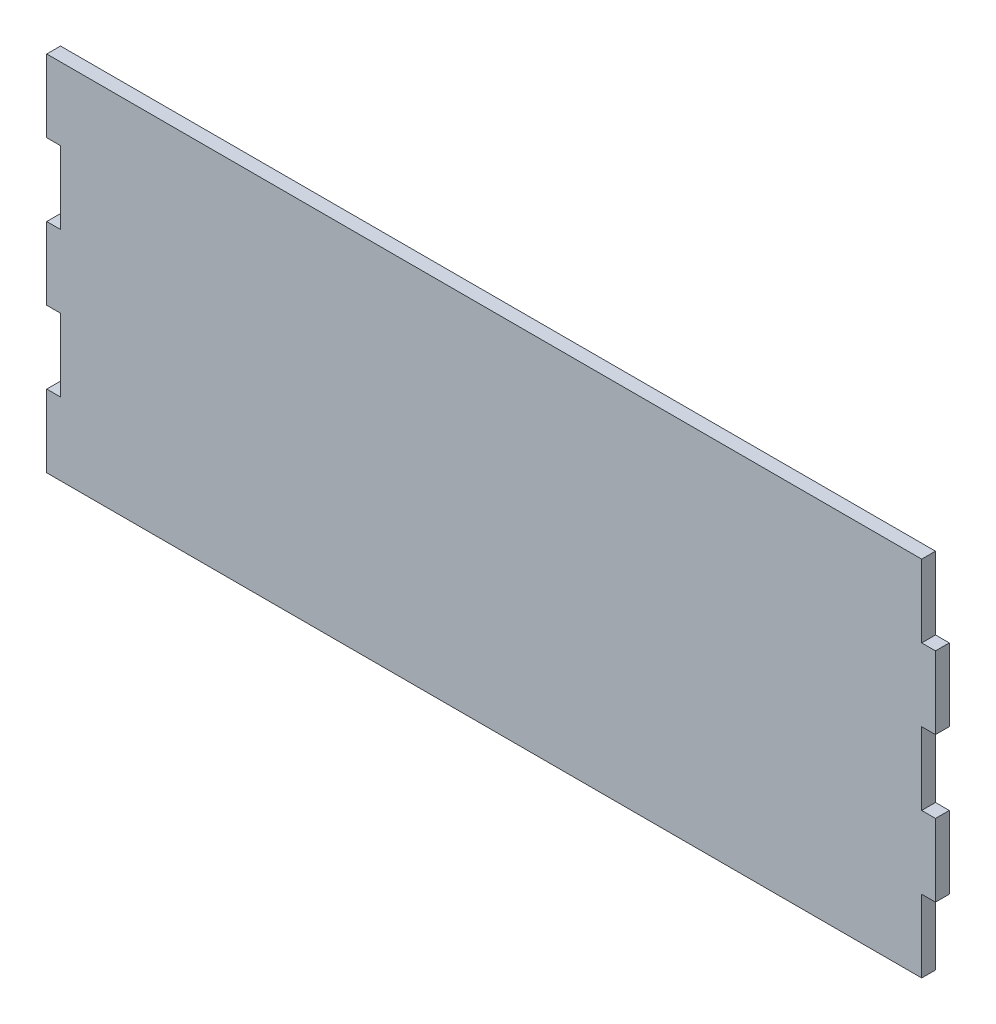
ISO-10303-21;
HEADER;
FILE_DESCRIPTION(('STEP AP214'),'2;1');
FILE_NAME('part.step','',(''),(''),'','','');
FILE_SCHEMA(('AUTOMOTIVE_DESIGN { 1 0 10303 214 1 1 1 1 }'));
ENDSEC;
DATA;
#1=APPLICATION_CONTEXT('core data for automotive mechanical design processes');
#2=APPLICATION_PROTOCOL_DEFINITION('international standard','automotive_design',2000,#1);
#3=PRODUCT_CONTEXT('',#1,'mechanical');
#4=PRODUCT('Part','Part','',(#3));
#5=PRODUCT_RELATED_PRODUCT_CATEGORY('part','',(#4));
#6=PRODUCT_DEFINITION_FORMATION('','',#4);
#7=PRODUCT_DEFINITION_CONTEXT('part definition',#1,'design');
#8=PRODUCT_DEFINITION('design','',#6,#7);
#9=PRODUCT_DEFINITION_SHAPE('','',#8);
#10=(LENGTH_UNIT() NAMED_UNIT(*) SI_UNIT(.MILLI.,.METRE.));
#11=(NAMED_UNIT(*) PLANE_ANGLE_UNIT() SI_UNIT($,.RADIAN.));
#12=(NAMED_UNIT(*) SI_UNIT($,.STERADIAN.) SOLID_ANGLE_UNIT());
#13=UNCERTAINTY_MEASURE_WITH_UNIT(LENGTH_MEASURE(1.E-05),#10,'distance_accuracy_value','');
#14=(GEOMETRIC_REPRESENTATION_CONTEXT(3) GLOBAL_UNCERTAINTY_ASSIGNED_CONTEXT((#13)) GLOBAL_UNIT_ASSIGNED_CONTEXT((#10,
#11,#12)) REPRESENTATION_CONTEXT('',''));
#15=CARTESIAN_POINT('',(0.,0.,0.));
#16=DIRECTION('',(0.,0.,1.));
#17=DIRECTION('',(1.,0.,0.));
#18=AXIS2_PLACEMENT_3D('',#15,#16,#17);
#19=CARTESIAN_POINT('',(0.,101.6,4.826));
#20=DIRECTION('',(-1.,0.,0.));
#21=DIRECTION('',(0.,0.,1.));
#22=AXIS2_PLACEMENT_3D('',#19,#20,#21);
#23=PLANE('',#22);
#24=DIRECTION('',(0.,1.,0.));
#25=VECTOR('',#24,1.);
#26=CARTESIAN_POINT('',(0.,101.6,0.));
#27=LINE('',#26,#25);
#28=CARTESIAN_POINT('',(0.,101.6,0.));
#29=VERTEX_POINT('',#28);
#30=CARTESIAN_POINT('',(0.,127.,0.));
#31=VERTEX_POINT('',#30);
#32=EDGE_CURVE('E205',#29,#31,#27,.T.);
#33=ORIENTED_EDGE('',*,*,#32,.T.);
#34=DIRECTION('',(0.,0.,-1.));
#35=VECTOR('',#34,1.);
#36=CARTESIAN_POINT('',(0.,127.,4.826));
#37=LINE('',#36,#35);
#38=CARTESIAN_POINT('',(0.,127.,4.826));
#39=VERTEX_POINT('',#38);
#40=EDGE_CURVE('E11',#39,#31,#37,.T.);
#41=ORIENTED_EDGE('',*,*,#40,.F.);
#42=DIRECTION('',(0.,1.,0.));
#43=VECTOR('',#42,1.);
#44=CARTESIAN_POINT('',(0.,101.6,4.826));
#45=LINE('',#44,#43);
#46=CARTESIAN_POINT('',(0.,101.6,4.826));
#47=VERTEX_POINT('',#46);
#48=EDGE_CURVE('E257',#47,#39,#45,.T.);
#49=ORIENTED_EDGE('',*,*,#48,.F.);
#50=DIRECTION('',(0.,0.,-1.));
#51=VECTOR('',#50,1.);
#52=CARTESIAN_POINT('',(0.,101.6,4.826));
#53=LINE('',#52,#51);
#54=EDGE_CURVE('E51',#47,#29,#53,.T.);
#55=ORIENTED_EDGE('',*,*,#54,.T.);
#56=EDGE_LOOP('',(#33,#41,#49,#55));
#57=FACE_BOUND('',#56,.T.);
#58=ADVANCED_FACE('F35',(#57),#23,.F.);
#59=CARTESIAN_POINT('',(0.,127.,4.826));
#60=DIRECTION('',(0.,-1.,0.));
#61=DIRECTION('',(0.,0.,-1.));
#62=AXIS2_PLACEMENT_3D('',#59,#60,#61);
#63=PLANE('',#62);
#64=DIRECTION('',(-1.,0.,0.));
#65=VECTOR('',#64,1.);
#66=CARTESIAN_POINT('',(0.,127.,0.));
#67=LINE('',#66,#65);
#68=CARTESIAN_POINT('',(-306.324,127.,0.));
#69=VERTEX_POINT('',#68);
#70=EDGE_CURVE('E207',#31,#69,#67,.T.);
#71=ORIENTED_EDGE('',*,*,#70,.T.);
#72=DIRECTION('',(0.,0.,-1.));
#73=VECTOR('',#72,1.);
#74=CARTESIAN_POINT('',(-306.324,127.,4.826));
#75=LINE('',#74,#73);
#76=CARTESIAN_POINT('',(-306.324,127.,4.826));
#77=VERTEX_POINT('',#76);
#78=EDGE_CURVE('E43',#77,#69,#75,.T.);
#79=ORIENTED_EDGE('',*,*,#78,.F.);
#80=DIRECTION('',(-1.,0.,0.));
#81=VECTOR('',#80,1.);
#82=CARTESIAN_POINT('',(0.,127.,4.826));
#83=LINE('',#82,#81);
#84=EDGE_CURVE('E125',#39,#77,#83,.T.);
#85=ORIENTED_EDGE('',*,*,#84,.F.);
#86=ORIENTED_EDGE('',*,*,#40,.T.);
#87=EDGE_LOOP('',(#71,#79,#85,#86));
#88=FACE_BOUND('',#87,.T.);
#89=ADVANCED_FACE('F297',(#88),#63,.F.);
#90=CARTESIAN_POINT('',(-306.324,101.6,4.826));
#91=DIRECTION('',(-1.,0.,0.));
#92=DIRECTION('',(0.,0.,1.));
#93=AXIS2_PLACEMENT_3D('',#90,#91,#92);
#94=PLANE('',#93);
#95=DIRECTION('',(0.,1.,0.));
#96=VECTOR('',#95,1.);
#97=CARTESIAN_POINT('',(-306.324,101.6,0.));
#98=LINE('',#97,#96);
#99=CARTESIAN_POINT('',(-306.324,101.6,0.));
#100=VERTEX_POINT('',#99);
#101=EDGE_CURVE('E210',#100,#69,#98,.T.);
#102=ORIENTED_EDGE('',*,*,#101,.F.);
#103=DIRECTION('',(0.,0.,-1.));
#104=VECTOR('',#103,1.);
#105=CARTESIAN_POINT('',(-306.324,101.6,4.826));
#106=LINE('',#105,#104);
#107=CARTESIAN_POINT('',(-306.324,101.6,4.826));
#108=VERTEX_POINT('',#107);
#109=EDGE_CURVE('E290',#108,#100,#106,.T.);
#110=ORIENTED_EDGE('',*,*,#109,.F.);
#111=DIRECTION('',(0.,1.,0.));
#112=VECTOR('',#111,1.);
#113=CARTESIAN_POINT('',(-306.324,101.6,4.826));
#114=LINE('',#113,#112);
#115=EDGE_CURVE('E296',#108,#77,#114,.T.);
#116=ORIENTED_EDGE('',*,*,#115,.T.);
#117=ORIENTED_EDGE('',*,*,#78,.T.);
#118=EDGE_LOOP('',(#102,#110,#116,#117));
#119=FACE_BOUND('',#118,.T.);
#120=ADVANCED_FACE('F294',(#119),#94,.T.);
#121=CARTESIAN_POINT('',(-306.324,101.6,4.826));
#122=DIRECTION('',(0.,1.,0.));
#123=DIRECTION('',(0.,0.,1.));
#124=AXIS2_PLACEMENT_3D('',#121,#122,#123);
#125=PLANE('',#124);
#126=DIRECTION('',(1.,0.,0.));
#127=VECTOR('',#126,1.);
#128=CARTESIAN_POINT('',(-306.324,101.6,0.));
#129=LINE('',#128,#127);
#130=CARTESIAN_POINT('',(-301.498,101.6,0.));
#131=VERTEX_POINT('',#130);
#132=EDGE_CURVE('E213',#100,#131,#129,.T.);
#133=ORIENTED_EDGE('',*,*,#132,.T.);
#134=DIRECTION('',(0.,0.,-1.));
#135=VECTOR('',#134,1.);
#136=CARTESIAN_POINT('',(-301.498,101.6,4.826));
#137=LINE('',#136,#135);
#138=CARTESIAN_POINT('',(-301.498,101.6,4.826));
#139=VERTEX_POINT('',#138);
#140=EDGE_CURVE('E287',#139,#131,#137,.T.);
#141=ORIENTED_EDGE('',*,*,#140,.F.);
#142=DIRECTION('',(1.,0.,0.));
#143=VECTOR('',#142,1.);
#144=CARTESIAN_POINT('',(-306.324,101.6,4.826));
#145=LINE('',#144,#143);
#146=EDGE_CURVE('E315',#108,#139,#145,.T.);
#147=ORIENTED_EDGE('',*,*,#146,.F.);
#148=ORIENTED_EDGE('',*,*,#109,.T.);
#149=EDGE_LOOP('',(#133,#141,#147,#148));
#150=FACE_BOUND('',#149,.T.);
#151=ADVANCED_FACE('F305',(#150),#125,.F.);
#152=CARTESIAN_POINT('',(-301.498,101.6,4.826));
#153=DIRECTION('',(1.,0.,0.));
#154=DIRECTION('',(0.,0.,-1.));
#155=AXIS2_PLACEMENT_3D('',#152,#153,#154);
#156=PLANE('',#155);
#157=DIRECTION('',(0.,-1.,0.));
#158=VECTOR('',#157,1.);
#159=CARTESIAN_POINT('',(-301.498,101.6,0.));
#160=LINE('',#159,#158);
#161=CARTESIAN_POINT('',(-301.498,76.2,0.));
#162=VERTEX_POINT('',#161);
#163=EDGE_CURVE('E215',#131,#162,#160,.T.);
#164=ORIENTED_EDGE('',*,*,#163,.T.);
#165=DIRECTION('',(0.,0.,-1.));
#166=VECTOR('',#165,1.);
#167=CARTESIAN_POINT('',(-301.498,76.2,4.826));
#168=LINE('',#167,#166);
#169=CARTESIAN_POINT('',(-301.498,76.2,4.826));
#170=VERTEX_POINT('',#169);
#171=EDGE_CURVE('E285',#170,#162,#168,.T.);
#172=ORIENTED_EDGE('',*,*,#171,.F.);
#173=DIRECTION('',(0.,-1.,0.));
#174=VECTOR('',#173,1.);
#175=CARTESIAN_POINT('',(-301.498,101.6,4.826));
#176=LINE('',#175,#174);
#177=EDGE_CURVE('E311',#139,#170,#176,.T.);
#178=ORIENTED_EDGE('',*,*,#177,.F.);
#179=ORIENTED_EDGE('',*,*,#140,.T.);
#180=EDGE_LOOP('',(#164,#172,#178,#179));
#181=FACE_BOUND('',#180,.T.);
#182=ADVANCED_FACE('F309',(#181),#156,.F.);
#183=CARTESIAN_POINT('',(-306.324,76.2,4.826));
#184=DIRECTION('',(0.,1.,0.));
#185=DIRECTION('',(0.,0.,1.));
#186=AXIS2_PLACEMENT_3D('',#183,#184,#185);
#187=PLANE('',#186);
#188=DIRECTION('',(1.,0.,0.));
#189=VECTOR('',#188,1.);
#190=CARTESIAN_POINT('',(-306.324,76.2,0.));
#191=LINE('',#190,#189);
#192=CARTESIAN_POINT('',(-306.324,76.2,0.));
#193=VERTEX_POINT('',#192);
#194=EDGE_CURVE('E218',#193,#162,#191,.T.);
#195=ORIENTED_EDGE('',*,*,#194,.F.);
#196=DIRECTION('',(0.,0.,-1.));
#197=VECTOR('',#196,1.);
#198=CARTESIAN_POINT('',(-306.324,76.2,4.826));
#199=LINE('',#198,#197);
#200=CARTESIAN_POINT('',(-306.324,76.2,4.826));
#201=VERTEX_POINT('',#200);
#202=EDGE_CURVE('E283',#201,#193,#199,.T.);
#203=ORIENTED_EDGE('',*,*,#202,.F.);
#204=DIRECTION('',(1.,0.,0.));
#205=VECTOR('',#204,1.);
#206=CARTESIAN_POINT('',(-306.324,76.2,4.826));
#207=LINE('',#206,#205);
#208=EDGE_CURVE('E314',#201,#170,#207,.T.);
#209=ORIENTED_EDGE('',*,*,#208,.T.);
#210=ORIENTED_EDGE('',*,*,#171,.T.);
#211=EDGE_LOOP('',(#195,#203,#209,#210));
#212=FACE_BOUND('',#211,.T.);
#213=ADVANCED_FACE('F502',(#212),#187,.T.);
#214=CARTESIAN_POINT('',(-306.324,50.8,4.826));
#215=DIRECTION('',(-1.,0.,0.));
#216=DIRECTION('',(0.,0.,1.));
#217=AXIS2_PLACEMENT_3D('',#214,#215,#216);
#218=PLANE('',#217);
#219=DIRECTION('',(0.,1.,0.));
#220=VECTOR('',#219,1.);
#221=CARTESIAN_POINT('',(-306.324,50.8,0.));
#222=LINE('',#221,#220);
#223=CARTESIAN_POINT('',(-306.324,50.8,0.));
#224=VERTEX_POINT('',#223);
#225=EDGE_CURVE('E221',#224,#193,#222,.T.);
#226=ORIENTED_EDGE('',*,*,#225,.F.);
#227=DIRECTION('',(0.,0.,-1.));
#228=VECTOR('',#227,1.);
#229=CARTESIAN_POINT('',(-306.324,50.8,4.826));
#230=LINE('',#229,#228);
#231=CARTESIAN_POINT('',(-306.324,50.8,4.826));
#232=VERTEX_POINT('',#231);
#233=EDGE_CURVE('E281',#232,#224,#230,.T.);
#234=ORIENTED_EDGE('',*,*,#233,.F.);
#235=DIRECTION('',(0.,1.,0.));
#236=VECTOR('',#235,1.);
#237=CARTESIAN_POINT('',(-306.324,50.8,4.826));
#238=LINE('',#237,#236);
#239=EDGE_CURVE('E317',#232,#201,#238,.T.);
#240=ORIENTED_EDGE('',*,*,#239,.T.);
#241=ORIENTED_EDGE('',*,*,#202,.T.);
#242=EDGE_LOOP('',(#226,#234,#240,#241));
#243=FACE_BOUND('',#242,.T.);
#244=ADVANCED_FACE('F492',(#243),#218,.T.);
#245=CARTESIAN_POINT('',(-306.324,50.8,4.826));
#246=DIRECTION('',(0.,1.,0.));
#247=DIRECTION('',(0.,0.,1.));
#248=AXIS2_PLACEMENT_3D('',#245,#246,#247);
#249=PLANE('',#248);
#250=DIRECTION('',(1.,0.,0.));
#251=VECTOR('',#250,1.);
#252=CARTESIAN_POINT('',(-306.324,50.8,0.));
#253=LINE('',#252,#251);
#254=CARTESIAN_POINT('',(-301.498,50.8,0.));
#255=VERTEX_POINT('',#254);
#256=EDGE_CURVE('E224',#224,#255,#253,.T.);
#257=ORIENTED_EDGE('',*,*,#256,.T.);
#258=DIRECTION('',(0.,0.,-1.));
#259=VECTOR('',#258,1.);
#260=CARTESIAN_POINT('',(-301.498,50.8,4.826));
#261=LINE('',#260,#259);
#262=CARTESIAN_POINT('',(-301.498,50.8,4.826));
#263=VERTEX_POINT('',#262);
#264=EDGE_CURVE('E278',#263,#255,#261,.T.);
#265=ORIENTED_EDGE('',*,*,#264,.F.);
#266=DIRECTION('',(1.,0.,0.));
#267=VECTOR('',#266,1.);
#268=CARTESIAN_POINT('',(-306.324,50.8,4.826));
#269=LINE('',#268,#267);
#270=EDGE_CURVE('E324',#232,#263,#269,.T.);
#271=ORIENTED_EDGE('',*,*,#270,.F.);
#272=ORIENTED_EDGE('',*,*,#233,.T.);
#273=EDGE_LOOP('',(#257,#265,#271,#272));
#274=FACE_BOUND('',#273,.T.);
#275=ADVANCED_FACE('F482',(#274),#249,.F.);
#276=CARTESIAN_POINT('',(-301.498,50.8,4.826));
#277=DIRECTION('',(1.,0.,0.));
#278=DIRECTION('',(0.,0.,-1.));
#279=AXIS2_PLACEMENT_3D('',#276,#277,#278);
#280=PLANE('',#279);
#281=DIRECTION('',(0.,-1.,0.));
#282=VECTOR('',#281,1.);
#283=CARTESIAN_POINT('',(-301.498,50.8,0.));
#284=LINE('',#283,#282);
#285=CARTESIAN_POINT('',(-301.498,25.4,0.));
#286=VERTEX_POINT('',#285);
#287=EDGE_CURVE('E226',#255,#286,#284,.T.);
#288=ORIENTED_EDGE('',*,*,#287,.T.);
#289=DIRECTION('',(0.,0.,-1.));
#290=VECTOR('',#289,1.);
#291=CARTESIAN_POINT('',(-301.498,25.4,4.826));
#292=LINE('',#291,#290);
#293=CARTESIAN_POINT('',(-301.498,25.4,4.826));
#294=VERTEX_POINT('',#293);
#295=EDGE_CURVE('E276',#294,#286,#292,.T.);
#296=ORIENTED_EDGE('',*,*,#295,.F.);
#297=DIRECTION('',(0.,-1.,0.));
#298=VECTOR('',#297,1.);
#299=CARTESIAN_POINT('',(-301.498,50.8,4.826));
#300=LINE('',#299,#298);
#301=EDGE_CURVE('E326',#263,#294,#300,.T.);
#302=ORIENTED_EDGE('',*,*,#301,.F.);
#303=ORIENTED_EDGE('',*,*,#264,.T.);
#304=EDGE_LOOP('',(#288,#296,#302,#303));
#305=FACE_BOUND('',#304,.T.);
#306=ADVANCED_FACE('F472',(#305),#280,.F.);
#307=CARTESIAN_POINT('',(-306.324,25.4,4.826));
#308=DIRECTION('',(0.,1.,0.));
#309=DIRECTION('',(0.,0.,1.));
#310=AXIS2_PLACEMENT_3D('',#307,#308,#309);
#311=PLANE('',#310);
#312=DIRECTION('',(1.,0.,0.));
#313=VECTOR('',#312,1.);
#314=CARTESIAN_POINT('',(-306.324,25.4,0.));
#315=LINE('',#314,#313);
#316=CARTESIAN_POINT('',(-306.324,25.4,0.));
#317=VERTEX_POINT('',#316);
#318=EDGE_CURVE('E229',#317,#286,#315,.T.);
#319=ORIENTED_EDGE('',*,*,#318,.F.);
#320=DIRECTION('',(0.,0.,-1.));
#321=VECTOR('',#320,1.);
#322=CARTESIAN_POINT('',(-306.324,25.4,4.826));
#323=LINE('',#322,#321);
#324=CARTESIAN_POINT('',(-306.324,25.4,4.826));
#325=VERTEX_POINT('',#324);
#326=EDGE_CURVE('E274',#325,#317,#323,.T.);
#327=ORIENTED_EDGE('',*,*,#326,.F.);
#328=DIRECTION('',(1.,0.,0.));
#329=VECTOR('',#328,1.);
#330=CARTESIAN_POINT('',(-306.324,25.4,4.826));
#331=LINE('',#330,#329);
#332=EDGE_CURVE('E328',#325,#294,#331,.T.);
#333=ORIENTED_EDGE('',*,*,#332,.T.);
#334=ORIENTED_EDGE('',*,*,#295,.T.);
#335=EDGE_LOOP('',(#319,#327,#333,#334));
#336=FACE_BOUND('',#335,.T.);
#337=ADVANCED_FACE('F462',(#336),#311,.T.);
#338=CARTESIAN_POINT('',(-306.324,0.,4.826));
#339=DIRECTION('',(-1.,0.,0.));
#340=DIRECTION('',(0.,0.,1.));
#341=AXIS2_PLACEMENT_3D('',#338,#339,#340);
#342=PLANE('',#341);
#343=DIRECTION('',(0.,1.,0.));
#344=VECTOR('',#343,1.);
#345=CARTESIAN_POINT('',(-306.324,0.,0.));
#346=LINE('',#345,#344);
#347=CARTESIAN_POINT('',(-306.324,0.,0.));
#348=VERTEX_POINT('',#347);
#349=EDGE_CURVE('E232',#348,#317,#346,.T.);
#350=ORIENTED_EDGE('',*,*,#349,.F.);
#351=DIRECTION('',(0.,0.,-1.));
#352=VECTOR('',#351,1.);
#353=CARTESIAN_POINT('',(-306.324,0.,4.826));
#354=LINE('',#353,#352);
#355=CARTESIAN_POINT('',(-306.324,0.,4.826));
#356=VERTEX_POINT('',#355);
#357=EDGE_CURVE('E272',#356,#348,#354,.T.);
#358=ORIENTED_EDGE('',*,*,#357,.F.);
#359=DIRECTION('',(0.,1.,0.));
#360=VECTOR('',#359,1.);
#361=CARTESIAN_POINT('',(-306.324,0.,4.826));
#362=LINE('',#361,#360);
#363=EDGE_CURVE('E331',#356,#325,#362,.T.);
#364=ORIENTED_EDGE('',*,*,#363,.T.);
#365=ORIENTED_EDGE('',*,*,#326,.T.);
#366=EDGE_LOOP('',(#350,#358,#364,#365));
#367=FACE_BOUND('',#366,.T.);
#368=ADVANCED_FACE('F452',(#367),#342,.T.);
#369=CARTESIAN_POINT('',(0.,0.,4.826));
#370=DIRECTION('',(0.,-1.,0.));
#371=DIRECTION('',(0.,0.,-1.));
#372=AXIS2_PLACEMENT_3D('',#369,#370,#371);
#373=PLANE('',#372);
#374=DIRECTION('',(-1.,0.,0.));
#375=VECTOR('',#374,1.);
#376=CARTESIAN_POINT('',(0.,0.,0.));
#377=LINE('',#376,#375);
#378=CARTESIAN_POINT('',(0.,0.,0.));
#379=VERTEX_POINT('',#378);
#380=EDGE_CURVE('E235',#379,#348,#377,.T.);
#381=ORIENTED_EDGE('',*,*,#380,.F.);
#382=DIRECTION('',(0.,0.,-1.));
#383=VECTOR('',#382,1.);
#384=CARTESIAN_POINT('',(0.,0.,4.826));
#385=LINE('',#384,#383);
#386=CARTESIAN_POINT('',(0.,0.,4.826));
#387=VERTEX_POINT('',#386);
#388=EDGE_CURVE('E270',#387,#379,#385,.T.);
#389=ORIENTED_EDGE('',*,*,#388,.F.);
#390=DIRECTION('',(-1.,0.,0.));
#391=VECTOR('',#390,1.);
#392=CARTESIAN_POINT('',(0.,0.,4.826));
#393=LINE('',#392,#391);
#394=EDGE_CURVE('E334',#387,#356,#393,.T.);
#395=ORIENTED_EDGE('',*,*,#394,.T.);
#396=ORIENTED_EDGE('',*,*,#357,.T.);
#397=EDGE_LOOP('',(#381,#389,#395,#396));
#398=FACE_BOUND('',#397,.T.);
#399=ADVANCED_FACE('F442',(#398),#373,.T.);
#400=CARTESIAN_POINT('',(0.,0.,4.826));
#401=DIRECTION('',(-1.,0.,0.));
#402=DIRECTION('',(0.,0.,1.));
#403=AXIS2_PLACEMENT_3D('',#400,#401,#402);
#404=PLANE('',#403);
#405=DIRECTION('',(0.,1.,0.));
#406=VECTOR('',#405,1.);
#407=CARTESIAN_POINT('',(0.,0.,0.));
#408=LINE('',#407,#406);
#409=CARTESIAN_POINT('',(0.,25.4,0.));
#410=VERTEX_POINT('',#409);
#411=EDGE_CURVE('E238',#379,#410,#408,.T.);
#412=ORIENTED_EDGE('',*,*,#411,.T.);
#413=DIRECTION('',(0.,0.,-1.));
#414=VECTOR('',#413,1.);
#415=CARTESIAN_POINT('',(0.,25.4,4.826));
#416=LINE('',#415,#414);
#417=CARTESIAN_POINT('',(0.,25.4,4.826));
#418=VERTEX_POINT('',#417);
#419=EDGE_CURVE('E267',#418,#410,#416,.T.);
#420=ORIENTED_EDGE('',*,*,#419,.F.);
#421=DIRECTION('',(0.,1.,0.));
#422=VECTOR('',#421,1.);
#423=CARTESIAN_POINT('',(0.,0.,4.826));
#424=LINE('',#423,#422);
#425=EDGE_CURVE('E337',#387,#418,#424,.T.);
#426=ORIENTED_EDGE('',*,*,#425,.F.);
#427=ORIENTED_EDGE('',*,*,#388,.T.);
#428=EDGE_LOOP('',(#412,#420,#426,#427));
#429=FACE_BOUND('',#428,.T.);
#430=ADVANCED_FACE('F432',(#429),#404,.F.);
#431=CARTESIAN_POINT('',(0.,25.4,4.826));
#432=DIRECTION('',(0.,1.,0.));
#433=DIRECTION('',(-1.,0.,0.));
#434=AXIS2_PLACEMENT_3D('',#431,#432,#433);
#435=PLANE('',#434);
#436=DIRECTION('',(1.,0.,0.));
#437=VECTOR('',#436,1.);
#438=CARTESIAN_POINT('',(0.,25.4,0.));
#439=LINE('',#438,#437);
#440=CARTESIAN_POINT('',(4.826,25.4,0.));
#441=VERTEX_POINT('',#440);
#442=EDGE_CURVE('E240',#410,#441,#439,.T.);
#443=ORIENTED_EDGE('',*,*,#442,.T.);
#444=DIRECTION('',(0.,0.,-1.));
#445=VECTOR('',#444,1.);
#446=CARTESIAN_POINT('',(4.826,25.4,4.826));
#447=LINE('',#446,#445);
#448=CARTESIAN_POINT('',(4.826,25.4,4.826));
#449=VERTEX_POINT('',#448);
#450=EDGE_CURVE('E265',#449,#441,#447,.T.);
#451=ORIENTED_EDGE('',*,*,#450,.F.);
#452=DIRECTION('',(1.,0.,0.));
#453=VECTOR('',#452,1.);
#454=CARTESIAN_POINT('',(0.,25.4,4.826));
#455=LINE('',#454,#453);
#456=EDGE_CURVE('E339',#418,#449,#455,.T.);
#457=ORIENTED_EDGE('',*,*,#456,.F.);
#458=ORIENTED_EDGE('',*,*,#419,.T.);
#459=EDGE_LOOP('',(#443,#451,#457,#458));
#460=FACE_BOUND('',#459,.T.);
#461=ADVANCED_FACE('F423',(#460),#435,.F.);
#462=CARTESIAN_POINT('',(4.826,50.8,4.826));
#463=DIRECTION('',(1.,0.,0.));
#464=DIRECTION('',(0.,0.,-1.));
#465=AXIS2_PLACEMENT_3D('',#462,#463,#464);
#466=PLANE('',#465);
#467=DIRECTION('',(0.,-1.,0.));
#468=VECTOR('',#467,1.);
#469=CARTESIAN_POINT('',(4.826,50.8,0.));
#470=LINE('',#469,#468);
#471=CARTESIAN_POINT('',(4.826,50.8,0.));
#472=VERTEX_POINT('',#471);
#473=EDGE_CURVE('E243',#472,#441,#470,.T.);
#474=ORIENTED_EDGE('',*,*,#473,.F.);
#475=DIRECTION('',(0.,0.,-1.));
#476=VECTOR('',#475,1.);
#477=CARTESIAN_POINT('',(4.826,50.8,4.826));
#478=LINE('',#477,#476);
#479=CARTESIAN_POINT('',(4.826,50.8,4.826));
#480=VERTEX_POINT('',#479);
#481=EDGE_CURVE('E263',#480,#472,#478,.T.);
#482=ORIENTED_EDGE('',*,*,#481,.F.);
#483=DIRECTION('',(0.,-1.,0.));
#484=VECTOR('',#483,1.);
#485=CARTESIAN_POINT('',(4.826,50.8,4.826));
#486=LINE('',#485,#484);
#487=EDGE_CURVE('E341',#480,#449,#486,.T.);
#488=ORIENTED_EDGE('',*,*,#487,.T.);
#489=ORIENTED_EDGE('',*,*,#450,.T.);
#490=EDGE_LOOP('',(#474,#482,#488,#489));
#491=FACE_BOUND('',#490,.T.);
#492=ADVANCED_FACE('F354',(#491),#466,.T.);
#493=CARTESIAN_POINT('',(0.,50.8,4.826));
#494=DIRECTION('',(0.,1.,0.));
#495=DIRECTION('',(-1.,0.,0.));
#496=AXIS2_PLACEMENT_3D('',#493,#494,#495);
#497=PLANE('',#496);
#498=DIRECTION('',(1.,0.,0.));
#499=VECTOR('',#498,1.);
#500=CARTESIAN_POINT('',(0.,50.8,0.));
#501=LINE('',#500,#499);
#502=CARTESIAN_POINT('',(0.,50.8,0.));
#503=VERTEX_POINT('',#502);
#504=EDGE_CURVE('E246',#503,#472,#501,.T.);
#505=ORIENTED_EDGE('',*,*,#504,.F.);
#506=DIRECTION('',(0.,0.,-1.));
#507=VECTOR('',#506,1.);
#508=CARTESIAN_POINT('',(0.,50.8,4.826));
#509=LINE('',#508,#507);
#510=CARTESIAN_POINT('',(0.,50.8,4.826));
#511=VERTEX_POINT('',#510);
#512=EDGE_CURVE('E261',#511,#503,#509,.T.);
#513=ORIENTED_EDGE('',*,*,#512,.F.);
#514=DIRECTION('',(1.,0.,0.));
#515=VECTOR('',#514,1.);
#516=CARTESIAN_POINT('',(0.,50.8,4.826));
#517=LINE('',#516,#515);
#518=EDGE_CURVE('E344',#511,#480,#517,.T.);
#519=ORIENTED_EDGE('',*,*,#518,.T.);
#520=ORIENTED_EDGE('',*,*,#481,.T.);
#521=EDGE_LOOP('',(#505,#513,#519,#520));
#522=FACE_BOUND('',#521,.T.);
#523=ADVANCED_FACE('F348',(#522),#497,.T.);
#524=CARTESIAN_POINT('',(0.,50.8,4.826));
#525=DIRECTION('',(-1.,0.,0.));
#526=DIRECTION('',(0.,0.,1.));
#527=AXIS2_PLACEMENT_3D('',#524,#525,#526);
#528=PLANE('',#527);
#529=DIRECTION('',(0.,1.,0.));
#530=VECTOR('',#529,1.);
#531=CARTESIAN_POINT('',(0.,50.8,0.));
#532=LINE('',#531,#530);
#533=CARTESIAN_POINT('',(0.,76.2,0.));
#534=VERTEX_POINT('',#533);
#535=EDGE_CURVE('E249',#503,#534,#532,.T.);
#536=ORIENTED_EDGE('',*,*,#535,.T.);
#537=DIRECTION('',(0.,0.,-1.));
#538=VECTOR('',#537,1.);
#539=CARTESIAN_POINT('',(0.,76.2,4.826));
#540=LINE('',#539,#538);
#541=CARTESIAN_POINT('',(0.,76.2,4.826));
#542=VERTEX_POINT('',#541);
#543=EDGE_CURVE('E197',#542,#534,#540,.T.);
#544=ORIENTED_EDGE('',*,*,#543,.F.);
#545=DIRECTION('',(0.,1.,0.));
#546=VECTOR('',#545,1.);
#547=CARTESIAN_POINT('',(0.,50.8,4.826));
#548=LINE('',#547,#546);
#549=EDGE_CURVE('E185',#511,#542,#548,.T.);
#550=ORIENTED_EDGE('',*,*,#549,.F.);
#551=ORIENTED_EDGE('',*,*,#512,.T.);
#552=EDGE_LOOP('',(#536,#544,#550,#551));
#553=FACE_BOUND('',#552,.T.);
#554=ADVANCED_FACE('F358',(#553),#528,.F.);
#555=CARTESIAN_POINT('',(0.,76.2,4.826));
#556=DIRECTION('',(0.,1.,0.));
#557=DIRECTION('',(0.,0.,1.));
#558=AXIS2_PLACEMENT_3D('',#555,#556,#557);
#559=PLANE('',#558);
#560=DIRECTION('',(1.,0.,0.));
#561=VECTOR('',#560,1.);
#562=CARTESIAN_POINT('',(0.,76.2,0.));
#563=LINE('',#562,#561);
#564=CARTESIAN_POINT('',(4.826,76.2,0.));
#565=VERTEX_POINT('',#564);
#566=EDGE_CURVE('E194',#534,#565,#563,.T.);
#567=ORIENTED_EDGE('',*,*,#566,.T.);
#568=DIRECTION('',(0.,0.,-1.));
#569=VECTOR('',#568,1.);
#570=CARTESIAN_POINT('',(4.826,76.2,4.826));
#571=LINE('',#570,#569);
#572=CARTESIAN_POINT('',(4.826,76.2,4.826));
#573=VERTEX_POINT('',#572);
#574=EDGE_CURVE('E191',#573,#565,#571,.T.);
#575=ORIENTED_EDGE('',*,*,#574,.F.);
#576=DIRECTION('',(1.,0.,0.));
#577=VECTOR('',#576,1.);
#578=CARTESIAN_POINT('',(0.,76.2,4.826));
#579=LINE('',#578,#577);
#580=EDGE_CURVE('E177',#542,#573,#579,.T.);
#581=ORIENTED_EDGE('',*,*,#580,.F.);
#582=ORIENTED_EDGE('',*,*,#543,.T.);
#583=EDGE_LOOP('',(#567,#575,#581,#582));
#584=FACE_BOUND('',#583,.T.);
#585=ADVANCED_FACE('F192',(#584),#559,.F.);
#586=CARTESIAN_POINT('',(4.826,101.6,4.826));
#587=DIRECTION('',(1.,0.,0.));
#588=DIRECTION('',(0.,0.,-1.));
#589=AXIS2_PLACEMENT_3D('',#586,#587,#588);
#590=PLANE('',#589);
#591=DIRECTION('',(0.,-1.,0.));
#592=VECTOR('',#591,1.);
#593=CARTESIAN_POINT('',(4.826,101.6,0.));
#594=LINE('',#593,#592);
#595=CARTESIAN_POINT('',(4.826,101.6,0.));
#596=VERTEX_POINT('',#595);
#597=EDGE_CURVE('E252',#596,#565,#594,.T.);
#598=ORIENTED_EDGE('',*,*,#597,.F.);
#599=DIRECTION('',(0.,0.,-1.));
#600=VECTOR('',#599,1.);
#601=CARTESIAN_POINT('',(4.826,101.6,4.826));
#602=LINE('',#601,#600);
#603=CARTESIAN_POINT('',(4.826,101.6,4.826));
#604=VERTEX_POINT('',#603);
#605=EDGE_CURVE('E113',#604,#596,#602,.T.);
#606=ORIENTED_EDGE('',*,*,#605,.F.);
#607=DIRECTION('',(0.,-1.,0.));
#608=VECTOR('',#607,1.);
#609=CARTESIAN_POINT('',(4.826,101.6,4.826));
#610=LINE('',#609,#608);
#611=EDGE_CURVE('E182',#604,#573,#610,.T.);
#612=ORIENTED_EDGE('',*,*,#611,.T.);
#613=ORIENTED_EDGE('',*,*,#574,.T.);
#614=EDGE_LOOP('',(#598,#606,#612,#613));
#615=FACE_BOUND('',#614,.T.);
#616=ADVANCED_FACE('F199',(#615),#590,.T.);
#617=CARTESIAN_POINT('',(0.,101.6,4.826));
#618=DIRECTION('',(0.,1.,0.));
#619=DIRECTION('',(0.,0.,1.));
#620=AXIS2_PLACEMENT_3D('',#617,#618,#619);
#621=PLANE('',#620);
#622=DIRECTION('',(1.,0.,0.));
#623=VECTOR('',#622,1.);
#624=CARTESIAN_POINT('',(0.,101.6,0.));
#625=LINE('',#624,#623);
#626=EDGE_CURVE('E254',#29,#596,#625,.T.);
#627=ORIENTED_EDGE('',*,*,#626,.F.);
#628=ORIENTED_EDGE('',*,*,#54,.F.);
#629=DIRECTION('',(1.,0.,0.));
#630=VECTOR('',#629,1.);
#631=CARTESIAN_POINT('',(0.,101.6,4.826));
#632=LINE('',#631,#630);
#633=EDGE_CURVE('E200',#47,#604,#632,.T.);
#634=ORIENTED_EDGE('',*,*,#633,.T.);
#635=ORIENTED_EDGE('',*,*,#605,.T.);
#636=EDGE_LOOP('',(#627,#628,#634,#635));
#637=FACE_BOUND('',#636,.T.);
#638=ADVANCED_FACE('F371',(#637),#621,.T.);
#639=CARTESIAN_POINT('',(0.,0.,4.826));
#640=DIRECTION('',(0.,0.,1.));
#641=DIRECTION('',(1.,0.,0.));
#642=AXIS2_PLACEMENT_3D('',#639,#640,#641);
#643=PLANE('',#642);
#644=ORIENTED_EDGE('',*,*,#48,.T.);
#645=ORIENTED_EDGE('',*,*,#84,.T.);
#646=ORIENTED_EDGE('',*,*,#115,.F.);
#647=ORIENTED_EDGE('',*,*,#146,.T.);
#648=ORIENTED_EDGE('',*,*,#177,.T.);
#649=ORIENTED_EDGE('',*,*,#208,.F.);
#650=ORIENTED_EDGE('',*,*,#239,.F.);
#651=ORIENTED_EDGE('',*,*,#270,.T.);
#652=ORIENTED_EDGE('',*,*,#301,.T.);
#653=ORIENTED_EDGE('',*,*,#332,.F.);
#654=ORIENTED_EDGE('',*,*,#363,.F.);
#655=ORIENTED_EDGE('',*,*,#394,.F.);
#656=ORIENTED_EDGE('',*,*,#425,.T.);
#657=ORIENTED_EDGE('',*,*,#456,.T.);
#658=ORIENTED_EDGE('',*,*,#487,.F.);
#659=ORIENTED_EDGE('',*,*,#518,.F.);
#660=ORIENTED_EDGE('',*,*,#549,.T.);
#661=ORIENTED_EDGE('',*,*,#580,.T.);
#662=ORIENTED_EDGE('',*,*,#611,.F.);
#663=ORIENTED_EDGE('',*,*,#633,.F.);
#664=EDGE_LOOP('',(#644,#645,#646,#647,#648,#649,#650,#651,#652,#653,#654,#655,#656,#657,#658,
#659,#660,#661,#662,#663));
#665=FACE_BOUND('',#664,.T.);
#666=ADVANCED_FACE('F179',(#665),#643,.T.);
#667=CARTESIAN_POINT('',(0.,0.,0.));
#668=DIRECTION('',(0.,0.,1.));
#669=DIRECTION('',(1.,0.,0.));
#670=AXIS2_PLACEMENT_3D('',#667,#668,#669);
#671=PLANE('',#670);
#672=ORIENTED_EDGE('',*,*,#32,.F.);
#673=ORIENTED_EDGE('',*,*,#626,.T.);
#674=ORIENTED_EDGE('',*,*,#597,.T.);
#675=ORIENTED_EDGE('',*,*,#566,.F.);
#676=ORIENTED_EDGE('',*,*,#535,.F.);
#677=ORIENTED_EDGE('',*,*,#504,.T.);
#678=ORIENTED_EDGE('',*,*,#473,.T.);
#679=ORIENTED_EDGE('',*,*,#442,.F.);
#680=ORIENTED_EDGE('',*,*,#411,.F.);
#681=ORIENTED_EDGE('',*,*,#380,.T.);
#682=ORIENTED_EDGE('',*,*,#349,.T.);
#683=ORIENTED_EDGE('',*,*,#318,.T.);
#684=ORIENTED_EDGE('',*,*,#287,.F.);
#685=ORIENTED_EDGE('',*,*,#256,.F.);
#686=ORIENTED_EDGE('',*,*,#225,.T.);
#687=ORIENTED_EDGE('',*,*,#194,.T.);
#688=ORIENTED_EDGE('',*,*,#163,.F.);
#689=ORIENTED_EDGE('',*,*,#132,.F.);
#690=ORIENTED_EDGE('',*,*,#101,.T.);
#691=ORIENTED_EDGE('',*,*,#70,.F.);
#692=EDGE_LOOP('',(#672,#673,#674,#675,#676,#677,#678,#679,#680,#681,#682,#683,#684,#685,#686,
#687,#688,#689,#690,#691));
#693=FACE_BOUND('',#692,.T.);
#694=ADVANCED_FACE('F301',(#693),#671,.F.);
#695=CLOSED_SHELL('',(#58,#89,#120,#151,#182,#213,#244,#275,#306,#337,#368,#399,#430,#461,#492,
#523,#554,#585,#616,#638,#666,#694));
#696=MANIFOLD_SOLID_BREP('B2',#695);
#697=ADVANCED_BREP_SHAPE_REPRESENTATION('',(#18,#696),#14);
#698=SHAPE_DEFINITION_REPRESENTATION(#9,#697);
ENDSEC;
END-ISO-10303-21;
